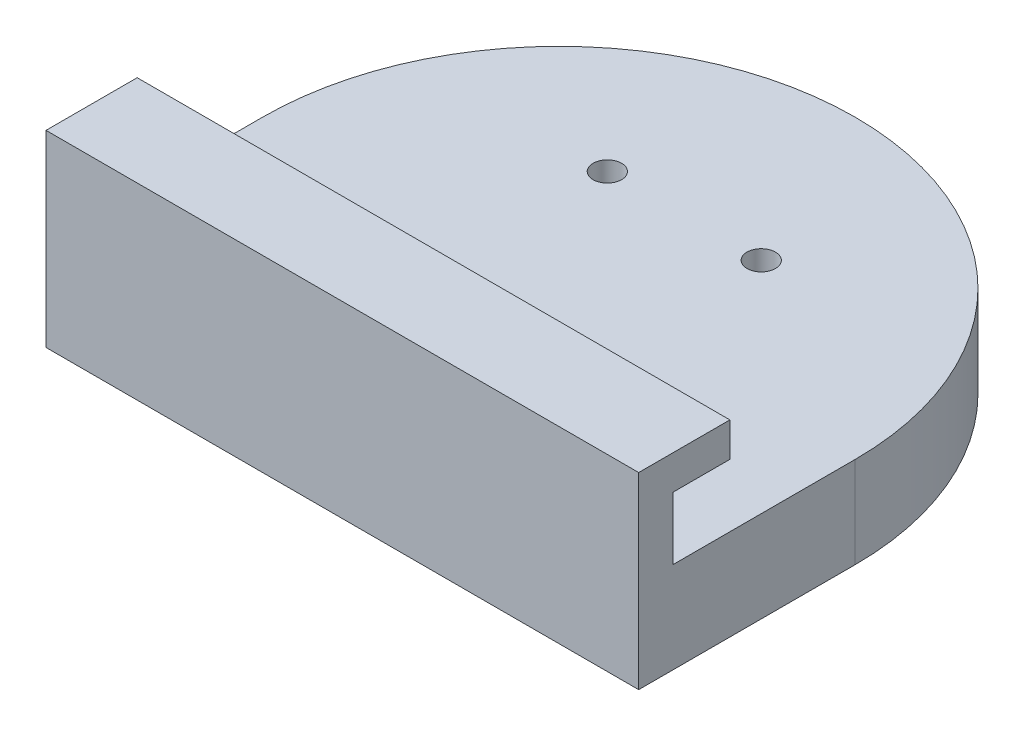
ISO-10303-21;
HEADER;
FILE_DESCRIPTION(('STEP AP214'),'2;1');
FILE_NAME('part.step','',(''),(''),'','','');
FILE_SCHEMA(('AUTOMOTIVE_DESIGN { 1 0 10303 214 1 1 1 1 }'));
ENDSEC;
DATA;
#1=APPLICATION_CONTEXT('core data for automotive mechanical design processes');
#2=APPLICATION_PROTOCOL_DEFINITION('international standard','automotive_design',2000,#1);
#3=PRODUCT_CONTEXT('',#1,'mechanical');
#4=PRODUCT('Part','Part','',(#3));
#5=PRODUCT_RELATED_PRODUCT_CATEGORY('part','',(#4));
#6=PRODUCT_DEFINITION_FORMATION('','',#4);
#7=PRODUCT_DEFINITION_CONTEXT('part definition',#1,'design');
#8=PRODUCT_DEFINITION('design','',#6,#7);
#9=PRODUCT_DEFINITION_SHAPE('','',#8);
#10=(LENGTH_UNIT() NAMED_UNIT(*) SI_UNIT(.MILLI.,.METRE.));
#11=(NAMED_UNIT(*) PLANE_ANGLE_UNIT() SI_UNIT($,.RADIAN.));
#12=(NAMED_UNIT(*) SI_UNIT($,.STERADIAN.) SOLID_ANGLE_UNIT());
#13=UNCERTAINTY_MEASURE_WITH_UNIT(LENGTH_MEASURE(1.E-05),#10,'distance_accuracy_value','');
#14=(GEOMETRIC_REPRESENTATION_CONTEXT(3) GLOBAL_UNCERTAINTY_ASSIGNED_CONTEXT((#13)) GLOBAL_UNIT_ASSIGNED_CONTEXT((#10,
#11,#12)) REPRESENTATION_CONTEXT('',''));
#15=CARTESIAN_POINT('',(0.,0.,0.));
#16=DIRECTION('',(0.,0.,1.));
#17=DIRECTION('',(1.,0.,0.));
#18=AXIS2_PLACEMENT_3D('',#15,#16,#17);
#19=CARTESIAN_POINT('',(0.,0.,0.));
#20=DIRECTION('',(0.,1.,0.));
#21=DIRECTION('',(0.,0.,1.));
#22=AXIS2_PLACEMENT_3D('',#19,#20,#21);
#23=PLANE('',#22);
#24=CARTESIAN_POINT('',(6.75,0.,-11.));
#25=DIRECTION('',(0.,-1.,0.));
#26=DIRECTION('',(0.,0.,-1.));
#27=AXIS2_PLACEMENT_3D('',#24,#25,#26);
#28=CIRCLE('',#27,1.25);
#29=CARTESIAN_POINT('',(6.75,0.,-12.25));
#30=VERTEX_POINT('',#29);
#31=EDGE_CURVE('E203',#30,#30,#28,.T.);
#32=ORIENTED_EDGE('',*,*,#31,.F.);
#33=EDGE_LOOP('',(#32));
#34=FACE_BOUND('',#33,.T.);
#35=CARTESIAN_POINT('',(-6.75,0.,-11.));
#36=DIRECTION('',(0.,-1.,0.));
#37=DIRECTION('',(0.,0.,-1.));
#38=AXIS2_PLACEMENT_3D('',#35,#36,#37);
#39=CIRCLE('',#38,1.25);
#40=CARTESIAN_POINT('',(-6.75,0.,-12.25));
#41=VERTEX_POINT('',#40);
#42=EDGE_CURVE('E197',#41,#41,#39,.T.);
#43=ORIENTED_EDGE('',*,*,#42,.F.);
#44=EDGE_LOOP('',(#43));
#45=FACE_BOUND('',#44,.T.);
#46=CARTESIAN_POINT('',(6.75,0.,11.));
#47=DIRECTION('',(0.,-1.,0.));
#48=DIRECTION('',(0.,0.,-1.));
#49=AXIS2_PLACEMENT_3D('',#46,#47,#48);
#50=CIRCLE('',#49,1.25);
#51=CARTESIAN_POINT('',(6.75,0.,9.75));
#52=VERTEX_POINT('',#51);
#53=EDGE_CURVE('E185',#52,#52,#50,.T.);
#54=ORIENTED_EDGE('',*,*,#53,.F.);
#55=EDGE_LOOP('',(#54));
#56=FACE_BOUND('',#55,.T.);
#57=CARTESIAN_POINT('',(0.,0.,0.));
#58=DIRECTION('',(0.,1.,0.));
#59=DIRECTION('',(0.,0.,1.));
#60=AXIS2_PLACEMENT_3D('',#57,#58,#59);
#61=CIRCLE('',#60,26.);
#62=CARTESIAN_POINT('',(-26.,0.,0.));
#63=VERTEX_POINT('',#62);
#64=CARTESIAN_POINT('',(26.,0.,0.));
#65=VERTEX_POINT('',#64);
#66=EDGE_CURVE('E152',#63,#65,#61,.F.);
#67=ORIENTED_EDGE('',*,*,#66,.T.);
#68=DIRECTION('',(0.,0.,-1.));
#69=VECTOR('',#68,1.);
#70=CARTESIAN_POINT('',(26.,0.,0.));
#71=LINE('',#70,#69);
#72=CARTESIAN_POINT('',(26.,0.,19.));
#73=VERTEX_POINT('',#72);
#74=EDGE_CURVE('E159',#73,#65,#71,.T.);
#75=ORIENTED_EDGE('',*,*,#74,.F.);
#76=DIRECTION('',(1.,0.,0.));
#77=VECTOR('',#76,1.);
#78=CARTESIAN_POINT('',(0.,0.,19.));
#79=LINE('',#78,#77);
#80=CARTESIAN_POINT('',(-26.,0.,19.));
#81=VERTEX_POINT('',#80);
#82=EDGE_CURVE('E157',#81,#73,#79,.T.);
#83=ORIENTED_EDGE('',*,*,#82,.F.);
#84=DIRECTION('',(0.,0.,1.));
#85=VECTOR('',#84,1.);
#86=CARTESIAN_POINT('',(-26.,0.,0.));
#87=LINE('',#86,#85);
#88=EDGE_CURVE('E155',#63,#81,#87,.T.);
#89=ORIENTED_EDGE('',*,*,#88,.F.);
#90=EDGE_LOOP('',(#67,#75,#83,#89));
#91=FACE_BOUND('',#90,.T.);
#92=CARTESIAN_POINT('',(-6.75,0.,11.));
#93=DIRECTION('',(0.,-1.,0.));
#94=DIRECTION('',(0.,0.,-1.));
#95=AXIS2_PLACEMENT_3D('',#92,#93,#94);
#96=CIRCLE('',#95,1.25);
#97=CARTESIAN_POINT('',(-6.75,0.,9.75));
#98=VERTEX_POINT('',#97);
#99=EDGE_CURVE('E191',#98,#98,#96,.T.);
#100=ORIENTED_EDGE('',*,*,#99,.F.);
#101=EDGE_LOOP('',(#100));
#102=FACE_BOUND('',#101,.T.);
#103=ADVANCED_FACE('F35',(#34,#45,#56,#91,#102),#23,.F.);
#104=CARTESIAN_POINT('',(0.,2.,0.));
#105=DIRECTION('',(0.,-1.,0.));
#106=DIRECTION('',(0.,0.,-1.));
#107=AXIS2_PLACEMENT_3D('',#104,#105,#106);
#108=CYLINDRICAL_SURFACE('',#107,26.);
#109=ORIENTED_EDGE('',*,*,#66,.F.);
#110=DIRECTION('',(0.,-1.,0.));
#111=VECTOR('',#110,1.);
#112=CARTESIAN_POINT('',(-26.,2.,0.));
#113=LINE('',#112,#111);
#114=CARTESIAN_POINT('',(-26.,8.,0.));
#115=VERTEX_POINT('',#114);
#116=EDGE_CURVE('E11',#115,#63,#113,.T.);
#117=ORIENTED_EDGE('',*,*,#116,.F.);
#118=CARTESIAN_POINT('',(0.,8.,0.));
#119=DIRECTION('',(0.,1.,0.));
#120=DIRECTION('',(0.,0.,1.));
#121=AXIS2_PLACEMENT_3D('',#118,#119,#120);
#122=CIRCLE('',#121,26.);
#123=CARTESIAN_POINT('',(26.,8.,0.));
#124=VERTEX_POINT('',#123);
#125=EDGE_CURVE('E142',#115,#124,#122,.F.);
#126=ORIENTED_EDGE('',*,*,#125,.T.);
#127=DIRECTION('',(0.,-1.,0.));
#128=VECTOR('',#127,1.);
#129=CARTESIAN_POINT('',(26.,2.,0.));
#130=LINE('',#129,#128);
#131=EDGE_CURVE('E58',#124,#65,#130,.T.);
#132=ORIENTED_EDGE('',*,*,#131,.T.);
#133=EDGE_LOOP('',(#109,#117,#126,#132));
#134=FACE_BOUND('',#133,.T.);
#135=ADVANCED_FACE('F37',(#134),#108,.T.);
#136=CARTESIAN_POINT('',(-26.,2.,0.));
#137=DIRECTION('',(1.,0.,0.));
#138=DIRECTION('',(0.,0.,-1.));
#139=AXIS2_PLACEMENT_3D('',#136,#137,#138);
#140=PLANE('',#139);
#141=ORIENTED_EDGE('',*,*,#88,.T.);
#142=DIRECTION('',(0.,-1.,0.));
#143=VECTOR('',#142,1.);
#144=CARTESIAN_POINT('',(-26.,2.,19.));
#145=LINE('',#144,#143);
#146=CARTESIAN_POINT('',(-26.,16.5,19.));
#147=VERTEX_POINT('',#146);
#148=EDGE_CURVE('E43',#147,#81,#145,.T.);
#149=ORIENTED_EDGE('',*,*,#148,.F.);
#150=DIRECTION('',(0.,0.,-1.));
#151=VECTOR('',#150,1.);
#152=CARTESIAN_POINT('',(-26.,16.5,19.));
#153=LINE('',#152,#151);
#154=CARTESIAN_POINT('',(-26.,16.5,11.));
#155=VERTEX_POINT('',#154);
#156=EDGE_CURVE('E126',#147,#155,#153,.T.);
#157=ORIENTED_EDGE('',*,*,#156,.T.);
#158=DIRECTION('',(0.,-1.,0.));
#159=VECTOR('',#158,1.);
#160=CARTESIAN_POINT('',(-26.,16.5,11.));
#161=LINE('',#160,#159);
#162=CARTESIAN_POINT('',(-26.,13.5,11.));
#163=VERTEX_POINT('',#162);
#164=EDGE_CURVE('E121',#155,#163,#161,.T.);
#165=ORIENTED_EDGE('',*,*,#164,.T.);
#166=DIRECTION('',(0.,0.,1.));
#167=VECTOR('',#166,1.);
#168=CARTESIAN_POINT('',(-26.,13.5,11.));
#169=LINE('',#168,#167);
#170=CARTESIAN_POINT('',(-26.,13.5,16.));
#171=VERTEX_POINT('',#170);
#172=EDGE_CURVE('E106',#163,#171,#169,.T.);
#173=ORIENTED_EDGE('',*,*,#172,.T.);
#174=DIRECTION('',(0.,-1.,0.));
#175=VECTOR('',#174,1.);
#176=CARTESIAN_POINT('',(-26.,13.5,16.));
#177=LINE('',#176,#175);
#178=CARTESIAN_POINT('',(-26.,8.,16.));
#179=VERTEX_POINT('',#178);
#180=EDGE_CURVE('E118',#171,#179,#177,.T.);
#181=ORIENTED_EDGE('',*,*,#180,.T.);
#182=DIRECTION('',(0.,0.,1.));
#183=VECTOR('',#182,1.);
#184=CARTESIAN_POINT('',(-26.,8.,0.));
#185=LINE('',#184,#183);
#186=EDGE_CURVE('E148',#115,#179,#185,.T.);
#187=ORIENTED_EDGE('',*,*,#186,.F.);
#188=ORIENTED_EDGE('',*,*,#116,.T.);
#189=EDGE_LOOP('',(#141,#149,#157,#165,#173,#181,#187,#188));
#190=FACE_BOUND('',#189,.T.);
#191=ADVANCED_FACE('F116',(#190),#140,.F.);
#192=CARTESIAN_POINT('',(0.,2.,19.));
#193=DIRECTION('',(0.,0.,-1.));
#194=DIRECTION('',(-1.,0.,0.));
#195=AXIS2_PLACEMENT_3D('',#192,#193,#194);
#196=PLANE('',#195);
#197=ORIENTED_EDGE('',*,*,#82,.T.);
#198=DIRECTION('',(0.,-1.,0.));
#199=VECTOR('',#198,1.);
#200=CARTESIAN_POINT('',(26.,2.,19.));
#201=LINE('',#200,#199);
#202=CARTESIAN_POINT('',(26.,16.5,19.));
#203=VERTEX_POINT('',#202);
#204=EDGE_CURVE('E162',#203,#73,#201,.T.);
#205=ORIENTED_EDGE('',*,*,#204,.F.);
#206=DIRECTION('',(-1.,0.,0.));
#207=VECTOR('',#206,1.);
#208=CARTESIAN_POINT('',(37.6726175299287,16.5,19.));
#209=LINE('',#208,#207);
#210=EDGE_CURVE('E125',#203,#147,#209,.T.);
#211=ORIENTED_EDGE('',*,*,#210,.T.);
#212=ORIENTED_EDGE('',*,*,#148,.T.);
#213=EDGE_LOOP('',(#197,#205,#211,#212));
#214=FACE_BOUND('',#213,.T.);
#215=ADVANCED_FACE('F167',(#214),#196,.F.);
#216=CARTESIAN_POINT('',(26.,2.,0.));
#217=DIRECTION('',(-1.,0.,0.));
#218=DIRECTION('',(0.,0.,1.));
#219=AXIS2_PLACEMENT_3D('',#216,#217,#218);
#220=PLANE('',#219);
#221=ORIENTED_EDGE('',*,*,#74,.T.);
#222=ORIENTED_EDGE('',*,*,#131,.F.);
#223=DIRECTION('',(0.,0.,-1.));
#224=VECTOR('',#223,1.);
#225=CARTESIAN_POINT('',(26.,8.,0.));
#226=LINE('',#225,#224);
#227=CARTESIAN_POINT('',(26.,8.,16.));
#228=VERTEX_POINT('',#227);
#229=EDGE_CURVE('E150',#228,#124,#226,.T.);
#230=ORIENTED_EDGE('',*,*,#229,.F.);
#231=DIRECTION('',(0.,-1.,0.));
#232=VECTOR('',#231,1.);
#233=CARTESIAN_POINT('',(26.,13.5,16.));
#234=LINE('',#233,#232);
#235=CARTESIAN_POINT('',(26.,13.5,16.));
#236=VERTEX_POINT('',#235);
#237=EDGE_CURVE('E141',#236,#228,#234,.T.);
#238=ORIENTED_EDGE('',*,*,#237,.F.);
#239=DIRECTION('',(0.,0.,1.));
#240=VECTOR('',#239,1.);
#241=CARTESIAN_POINT('',(26.,13.5,11.));
#242=LINE('',#241,#240);
#243=CARTESIAN_POINT('',(26.,13.5,11.));
#244=VERTEX_POINT('',#243);
#245=EDGE_CURVE('E107',#244,#236,#242,.T.);
#246=ORIENTED_EDGE('',*,*,#245,.F.);
#247=DIRECTION('',(0.,-1.,0.));
#248=VECTOR('',#247,1.);
#249=CARTESIAN_POINT('',(26.,16.5,11.));
#250=LINE('',#249,#248);
#251=CARTESIAN_POINT('',(26.,16.5,11.));
#252=VERTEX_POINT('',#251);
#253=EDGE_CURVE('E137',#252,#244,#250,.T.);
#254=ORIENTED_EDGE('',*,*,#253,.F.);
#255=DIRECTION('',(0.,0.,-1.));
#256=VECTOR('',#255,1.);
#257=CARTESIAN_POINT('',(26.,16.5,19.));
#258=LINE('',#257,#256);
#259=EDGE_CURVE('E134',#203,#252,#258,.T.);
#260=ORIENTED_EDGE('',*,*,#259,.F.);
#261=ORIENTED_EDGE('',*,*,#204,.T.);
#262=EDGE_LOOP('',(#221,#222,#230,#238,#246,#254,#260,#261));
#263=FACE_BOUND('',#262,.T.);
#264=ADVANCED_FACE('F175',(#263),#220,.F.);
#265=CARTESIAN_POINT('',(0.,8.,0.));
#266=DIRECTION('',(0.,1.,0.));
#267=DIRECTION('',(0.,0.,1.));
#268=AXIS2_PLACEMENT_3D('',#265,#266,#267);
#269=PLANE('',#268);
#270=CARTESIAN_POINT('',(6.75,8.,-11.));
#271=DIRECTION('',(0.,1.,0.));
#272=DIRECTION('',(0.,0.,1.));
#273=AXIS2_PLACEMENT_3D('',#270,#271,#272);
#274=CIRCLE('',#273,1.25);
#275=CARTESIAN_POINT('',(6.75,8.,-9.75));
#276=VERTEX_POINT('',#275);
#277=EDGE_CURVE('E200',#276,#276,#274,.T.);
#278=ORIENTED_EDGE('',*,*,#277,.F.);
#279=EDGE_LOOP('',(#278));
#280=FACE_BOUND('',#279,.T.);
#281=CARTESIAN_POINT('',(-6.75,8.,-11.));
#282=DIRECTION('',(0.,1.,0.));
#283=DIRECTION('',(0.,0.,1.));
#284=AXIS2_PLACEMENT_3D('',#281,#282,#283);
#285=CIRCLE('',#284,1.25);
#286=CARTESIAN_POINT('',(-6.75,8.,-9.75));
#287=VERTEX_POINT('',#286);
#288=EDGE_CURVE('E194',#287,#287,#285,.T.);
#289=ORIENTED_EDGE('',*,*,#288,.F.);
#290=EDGE_LOOP('',(#289));
#291=FACE_BOUND('',#290,.T.);
#292=CARTESIAN_POINT('',(-6.75,8.,11.));
#293=DIRECTION('',(0.,1.,0.));
#294=DIRECTION('',(0.,0.,1.));
#295=AXIS2_PLACEMENT_3D('',#292,#293,#294);
#296=CIRCLE('',#295,1.25);
#297=CARTESIAN_POINT('',(-6.75,8.,12.25));
#298=VERTEX_POINT('',#297);
#299=EDGE_CURVE('E188',#298,#298,#296,.T.);
#300=ORIENTED_EDGE('',*,*,#299,.F.);
#301=EDGE_LOOP('',(#300));
#302=FACE_BOUND('',#301,.T.);
#303=CARTESIAN_POINT('',(6.75,8.,11.));
#304=DIRECTION('',(0.,1.,0.));
#305=DIRECTION('',(0.,0.,1.));
#306=AXIS2_PLACEMENT_3D('',#303,#304,#305);
#307=CIRCLE('',#306,1.25);
#308=CARTESIAN_POINT('',(6.75,8.,12.25));
#309=VERTEX_POINT('',#308);
#310=EDGE_CURVE('E122',#309,#309,#307,.T.);
#311=ORIENTED_EDGE('',*,*,#310,.F.);
#312=EDGE_LOOP('',(#311));
#313=FACE_BOUND('',#312,.T.);
#314=DIRECTION('',(-1.,0.,0.));
#315=VECTOR('',#314,1.);
#316=CARTESIAN_POINT('',(37.6726175299287,8.,16.));
#317=LINE('',#316,#315);
#318=EDGE_CURVE('E50',#228,#179,#317,.T.);
#319=ORIENTED_EDGE('',*,*,#318,.F.);
#320=ORIENTED_EDGE('',*,*,#229,.T.);
#321=ORIENTED_EDGE('',*,*,#125,.F.);
#322=ORIENTED_EDGE('',*,*,#186,.T.);
#323=EDGE_LOOP('',(#319,#320,#321,#322));
#324=FACE_BOUND('',#323,.T.);
#325=ADVANCED_FACE('F224',(#280,#291,#302,#313,#324),#269,.T.);
#326=CARTESIAN_POINT('',(37.6726175299287,16.5,19.));
#327=DIRECTION('',(0.,-1.,0.));
#328=DIRECTION('',(0.,0.,-1.));
#329=AXIS2_PLACEMENT_3D('',#326,#327,#328);
#330=PLANE('',#329);
#331=ORIENTED_EDGE('',*,*,#210,.F.);
#332=ORIENTED_EDGE('',*,*,#259,.T.);
#333=DIRECTION('',(-1.,0.,0.));
#334=VECTOR('',#333,1.);
#335=CARTESIAN_POINT('',(37.6726175299287,16.5,11.));
#336=LINE('',#335,#334);
#337=EDGE_CURVE('E129',#252,#155,#336,.T.);
#338=ORIENTED_EDGE('',*,*,#337,.T.);
#339=ORIENTED_EDGE('',*,*,#156,.F.);
#340=EDGE_LOOP('',(#331,#332,#338,#339));
#341=FACE_BOUND('',#340,.T.);
#342=ADVANCED_FACE('F179',(#341),#330,.F.);
#343=CARTESIAN_POINT('',(37.6726175299287,16.5,11.));
#344=DIRECTION('',(0.,0.,1.));
#345=DIRECTION('',(1.,0.,0.));
#346=AXIS2_PLACEMENT_3D('',#343,#344,#345);
#347=PLANE('',#346);
#348=ORIENTED_EDGE('',*,*,#337,.F.);
#349=ORIENTED_EDGE('',*,*,#253,.T.);
#350=DIRECTION('',(-1.,0.,0.));
#351=VECTOR('',#350,1.);
#352=CARTESIAN_POINT('',(37.6726175299287,13.5,11.));
#353=LINE('',#352,#351);
#354=EDGE_CURVE('E111',#244,#163,#353,.T.);
#355=ORIENTED_EDGE('',*,*,#354,.T.);
#356=ORIENTED_EDGE('',*,*,#164,.F.);
#357=EDGE_LOOP('',(#348,#349,#355,#356));
#358=FACE_BOUND('',#357,.T.);
#359=ADVANCED_FACE('F181',(#358),#347,.F.);
#360=CARTESIAN_POINT('',(37.6726175299287,13.5,11.));
#361=DIRECTION('',(0.,1.,0.));
#362=DIRECTION('',(0.,0.,1.));
#363=AXIS2_PLACEMENT_3D('',#360,#361,#362);
#364=PLANE('',#363);
#365=ORIENTED_EDGE('',*,*,#354,.F.);
#366=ORIENTED_EDGE('',*,*,#245,.T.);
#367=DIRECTION('',(-1.,0.,0.));
#368=VECTOR('',#367,1.);
#369=CARTESIAN_POINT('',(37.6726175299287,13.5,16.));
#370=LINE('',#369,#368);
#371=EDGE_CURVE('E102',#236,#171,#370,.T.);
#372=ORIENTED_EDGE('',*,*,#371,.T.);
#373=ORIENTED_EDGE('',*,*,#172,.F.);
#374=EDGE_LOOP('',(#365,#366,#372,#373));
#375=FACE_BOUND('',#374,.T.);
#376=ADVANCED_FACE('F105',(#375),#364,.F.);
#377=CARTESIAN_POINT('',(37.6726175299287,13.5,16.));
#378=DIRECTION('',(0.,0.,1.));
#379=DIRECTION('',(1.,0.,0.));
#380=AXIS2_PLACEMENT_3D('',#377,#378,#379);
#381=PLANE('',#380);
#382=ORIENTED_EDGE('',*,*,#371,.F.);
#383=ORIENTED_EDGE('',*,*,#237,.T.);
#384=ORIENTED_EDGE('',*,*,#318,.T.);
#385=ORIENTED_EDGE('',*,*,#180,.F.);
#386=EDGE_LOOP('',(#382,#383,#384,#385));
#387=FACE_BOUND('',#386,.T.);
#388=ADVANCED_FACE('F124',(#387),#381,.F.);
#389=CARTESIAN_POINT('',(6.75,0.,11.));
#390=DIRECTION('',(0.,-1.,0.));
#391=DIRECTION('',(0.,0.,-1.));
#392=AXIS2_PLACEMENT_3D('',#389,#390,#391);
#393=CYLINDRICAL_SURFACE('',#392,1.25);
#394=ORIENTED_EDGE('',*,*,#53,.T.);
#395=EDGE_LOOP('',(#394));
#396=FACE_BOUND('',#395,.T.);
#397=ORIENTED_EDGE('',*,*,#310,.T.);
#398=EDGE_LOOP('',(#397));
#399=FACE_BOUND('',#398,.T.);
#400=ADVANCED_FACE('F217',(#396,#399),#393,.F.);
#401=CARTESIAN_POINT('',(-6.75,0.,11.));
#402=DIRECTION('',(0.,-1.,0.));
#403=DIRECTION('',(0.,0.,-1.));
#404=AXIS2_PLACEMENT_3D('',#401,#402,#403);
#405=CYLINDRICAL_SURFACE('',#404,1.25);
#406=ORIENTED_EDGE('',*,*,#99,.T.);
#407=EDGE_LOOP('',(#406));
#408=FACE_BOUND('',#407,.T.);
#409=ORIENTED_EDGE('',*,*,#299,.T.);
#410=EDGE_LOOP('',(#409));
#411=FACE_BOUND('',#410,.T.);
#412=ADVANCED_FACE('F220',(#408,#411),#405,.F.);
#413=CARTESIAN_POINT('',(-6.75,0.,-11.));
#414=DIRECTION('',(0.,-1.,0.));
#415=DIRECTION('',(0.,0.,-1.));
#416=AXIS2_PLACEMENT_3D('',#413,#414,#415);
#417=CYLINDRICAL_SURFACE('',#416,1.25);
#418=ORIENTED_EDGE('',*,*,#42,.T.);
#419=EDGE_LOOP('',(#418));
#420=FACE_BOUND('',#419,.T.);
#421=ORIENTED_EDGE('',*,*,#288,.T.);
#422=EDGE_LOOP('',(#421));
#423=FACE_BOUND('',#422,.T.);
#424=ADVANCED_FACE('F277',(#420,#423),#417,.F.);
#425=CARTESIAN_POINT('',(6.75,0.,-11.));
#426=DIRECTION('',(0.,-1.,0.));
#427=DIRECTION('',(0.,0.,-1.));
#428=AXIS2_PLACEMENT_3D('',#425,#426,#427);
#429=CYLINDRICAL_SURFACE('',#428,1.25);
#430=ORIENTED_EDGE('',*,*,#31,.T.);
#431=EDGE_LOOP('',(#430));
#432=FACE_BOUND('',#431,.T.);
#433=ORIENTED_EDGE('',*,*,#277,.T.);
#434=EDGE_LOOP('',(#433));
#435=FACE_BOUND('',#434,.T.);
#436=ADVANCED_FACE('F207',(#432,#435),#429,.F.);
#437=CLOSED_SHELL('',(#103,#135,#191,#215,#264,#325,#342,#359,#376,#388,#400,#412,#424,#436));
#438=MANIFOLD_SOLID_BREP('B2',#437);
#439=ADVANCED_BREP_SHAPE_REPRESENTATION('',(#18,#438),#14);
#440=SHAPE_DEFINITION_REPRESENTATION(#9,#439);
ENDSEC;
END-ISO-10303-21;
